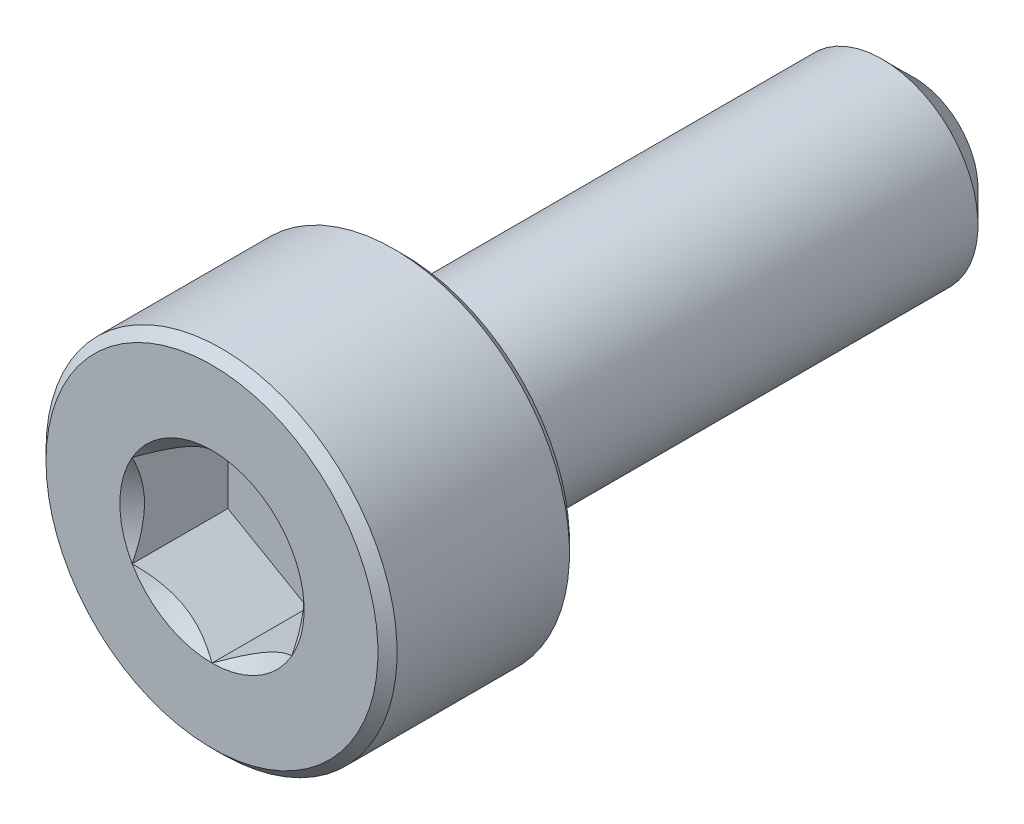
ISO-10303-21;
HEADER;
FILE_DESCRIPTION(('STEP AP214'),'2;1');
FILE_NAME('part.step','',(''),(''),'','','');
FILE_SCHEMA(('AUTOMOTIVE_DESIGN { 1 0 10303 214 1 1 1 1 }'));
ENDSEC;
DATA;
#1=APPLICATION_CONTEXT('core data for automotive mechanical design processes');
#2=APPLICATION_PROTOCOL_DEFINITION('international standard','automotive_design',2000,#1);
#3=PRODUCT_CONTEXT('',#1,'mechanical');
#4=PRODUCT('Part','Part','',(#3));
#5=PRODUCT_RELATED_PRODUCT_CATEGORY('part','',(#4));
#6=PRODUCT_DEFINITION_FORMATION('','',#4);
#7=PRODUCT_DEFINITION_CONTEXT('part definition',#1,'design');
#8=PRODUCT_DEFINITION('design','',#6,#7);
#9=PRODUCT_DEFINITION_SHAPE('','',#8);
#10=(LENGTH_UNIT() NAMED_UNIT(*) SI_UNIT(.MILLI.,.METRE.));
#11=(NAMED_UNIT(*) PLANE_ANGLE_UNIT() SI_UNIT($,.RADIAN.));
#12=(NAMED_UNIT(*) SI_UNIT($,.STERADIAN.) SOLID_ANGLE_UNIT());
#13=UNCERTAINTY_MEASURE_WITH_UNIT(LENGTH_MEASURE(1.E-05),#10,'distance_accuracy_value','');
#14=(GEOMETRIC_REPRESENTATION_CONTEXT(3) GLOBAL_UNCERTAINTY_ASSIGNED_CONTEXT((#13)) GLOBAL_UNIT_ASSIGNED_CONTEXT((#10,
#11,#12)) REPRESENTATION_CONTEXT('',''));
#15=CARTESIAN_POINT('',(0.,0.,0.));
#16=DIRECTION('',(0.,0.,1.));
#17=DIRECTION('',(1.,0.,0.));
#18=AXIS2_PLACEMENT_3D('',#15,#16,#17);
#19=CARTESIAN_POINT('',(0.,2.6,5.5));
#20=DIRECTION('',(0.,0.,1.));
#21=DIRECTION('',(1.,0.,0.));
#22=AXIS2_PLACEMENT_3D('',#19,#20,#21);
#23=PLANE('',#22);
#24=CARTESIAN_POINT('',(0.,0.,5.5));
#25=DIRECTION('',(0.,0.,1.));
#26=DIRECTION('',(1.,0.,0.));
#27=AXIS2_PLACEMENT_3D('',#24,#25,#26);
#28=CIRCLE('',#27,1.44337567297406);
#29=CARTESIAN_POINT('',(1.25,0.721687836487032,5.5));
#30=VERTEX_POINT('',#29);
#31=CARTESIAN_POINT('',(0.,1.44337567297406,5.5));
#32=VERTEX_POINT('',#31);
#33=EDGE_CURVE('E92',#30,#32,#28,.T.);
#34=ORIENTED_EDGE('',*,*,#33,.F.);
#35=CARTESIAN_POINT('',(1.25,-0.721687836487033,5.5));
#36=VERTEX_POINT('',#35);
#37=EDGE_CURVE('E52',#36,#30,#28,.T.);
#38=ORIENTED_EDGE('',*,*,#37,.F.);
#39=CARTESIAN_POINT('',(0.,-1.44337567297406,5.5));
#40=VERTEX_POINT('',#39);
#41=EDGE_CURVE('E278',#40,#36,#28,.T.);
#42=ORIENTED_EDGE('',*,*,#41,.F.);
#43=CARTESIAN_POINT('',(-1.25,-0.72168783648703,5.5));
#44=VERTEX_POINT('',#43);
#45=EDGE_CURVE('E59',#44,#40,#28,.T.);
#46=ORIENTED_EDGE('',*,*,#45,.F.);
#47=CARTESIAN_POINT('',(-1.25,0.721687836487034,5.5));
#48=VERTEX_POINT('',#47);
#49=EDGE_CURVE('E128',#48,#44,#28,.T.);
#50=ORIENTED_EDGE('',*,*,#49,.F.);
#51=EDGE_CURVE('E101',#32,#48,#28,.T.);
#52=ORIENTED_EDGE('',*,*,#51,.F.);
#53=EDGE_LOOP('',(#34,#38,#42,#46,#50,#52));
#54=FACE_BOUND('',#53,.T.);
#55=CARTESIAN_POINT('',(0.,0.,5.5));
#56=DIRECTION('',(0.,0.,-1.));
#57=DIRECTION('',(-1.,0.,0.));
#58=AXIS2_PLACEMENT_3D('',#55,#56,#57);
#59=CIRCLE('',#58,2.6);
#60=CARTESIAN_POINT('',(-2.6,0.,5.5));
#61=VERTEX_POINT('',#60);
#62=EDGE_CURVE('E46',#61,#61,#59,.T.);
#63=ORIENTED_EDGE('',*,*,#62,.F.);
#64=EDGE_LOOP('',(#63));
#65=FACE_BOUND('',#64,.T.);
#66=ADVANCED_FACE('F33',(#54,#65),#23,.T.);
#67=CARTESIAN_POINT('',(0.,0.,5.35));
#68=DIRECTION('',(0.,0.,-1.));
#69=DIRECTION('',(-1.,0.,0.));
#70=AXIS2_PLACEMENT_3D('',#67,#68,#69);
#71=CONICAL_SURFACE('',#70,2.75,0.785398163397443);
#72=ORIENTED_EDGE('',*,*,#62,.T.);
#73=EDGE_LOOP('',(#72));
#74=FACE_BOUND('',#73,.T.);
#75=CARTESIAN_POINT('',(0.,0.,5.35));
#76=DIRECTION('',(0.,0.,-1.));
#77=DIRECTION('',(-1.,0.,0.));
#78=AXIS2_PLACEMENT_3D('',#75,#76,#77);
#79=CIRCLE('',#78,2.75);
#80=CARTESIAN_POINT('',(-2.75,0.,5.35));
#81=VERTEX_POINT('',#80);
#82=EDGE_CURVE('E212',#81,#81,#79,.T.);
#83=ORIENTED_EDGE('',*,*,#82,.F.);
#84=EDGE_LOOP('',(#83));
#85=FACE_BOUND('',#84,.T.);
#86=ADVANCED_FACE('F217',(#74,#85),#71,.T.);
#87=CARTESIAN_POINT('',(0.,0.,-5.5));
#88=DIRECTION('',(0.,0.,-1.));
#89=DIRECTION('',(-1.,0.,0.));
#90=AXIS2_PLACEMENT_3D('',#87,#88,#89);
#91=CYLINDRICAL_SURFACE('',#90,2.75);
#92=ORIENTED_EDGE('',*,*,#82,.T.);
#93=EDGE_LOOP('',(#92));
#94=FACE_BOUND('',#93,.T.);
#95=CARTESIAN_POINT('',(0.,0.,2.65));
#96=DIRECTION('',(0.,0.,-1.));
#97=DIRECTION('',(-1.,0.,0.));
#98=AXIS2_PLACEMENT_3D('',#95,#96,#97);
#99=CIRCLE('',#98,2.75);
#100=CARTESIAN_POINT('',(-2.75,0.,2.65));
#101=VERTEX_POINT('',#100);
#102=EDGE_CURVE('E209',#101,#101,#99,.T.);
#103=ORIENTED_EDGE('',*,*,#102,.F.);
#104=EDGE_LOOP('',(#103));
#105=FACE_BOUND('',#104,.T.);
#106=ADVANCED_FACE('F223',(#94,#105),#91,.T.);
#107=CARTESIAN_POINT('',(0.,0.,2.5));
#108=DIRECTION('',(0.,0.,1.));
#109=DIRECTION('',(1.,0.,0.));
#110=AXIS2_PLACEMENT_3D('',#107,#108,#109);
#111=CONICAL_SURFACE('',#110,2.6,0.785398163397447);
#112=ORIENTED_EDGE('',*,*,#102,.T.);
#113=EDGE_LOOP('',(#112));
#114=FACE_BOUND('',#113,.T.);
#115=CARTESIAN_POINT('',(0.,0.,2.5));
#116=DIRECTION('',(0.,0.,-1.));
#117=DIRECTION('',(-1.,0.,0.));
#118=AXIS2_PLACEMENT_3D('',#115,#116,#117);
#119=CIRCLE('',#118,2.6);
#120=CARTESIAN_POINT('',(-2.6,0.,2.5));
#121=VERTEX_POINT('',#120);
#122=EDGE_CURVE('E206',#121,#121,#119,.T.);
#123=ORIENTED_EDGE('',*,*,#122,.F.);
#124=EDGE_LOOP('',(#123));
#125=FACE_BOUND('',#124,.T.);
#126=ADVANCED_FACE('F227',(#114,#125),#111,.T.);
#127=CARTESIAN_POINT('',(0.,2.6,2.5));
#128=DIRECTION('',(0.,0.,-1.));
#129=DIRECTION('',(-1.,0.,0.));
#130=AXIS2_PLACEMENT_3D('',#127,#128,#129);
#131=PLANE('',#130);
#132=ORIENTED_EDGE('',*,*,#122,.T.);
#133=EDGE_LOOP('',(#132));
#134=FACE_BOUND('',#133,.T.);
#135=CARTESIAN_POINT('',(0.,0.,2.5));
#136=DIRECTION('',(0.,0.,-1.));
#137=DIRECTION('',(-1.,0.,0.));
#138=AXIS2_PLACEMENT_3D('',#135,#136,#137);
#139=CIRCLE('',#138,1.5);
#140=CARTESIAN_POINT('',(-1.5,0.,2.5));
#141=VERTEX_POINT('',#140);
#142=EDGE_CURVE('E203',#141,#141,#139,.T.);
#143=ORIENTED_EDGE('',*,*,#142,.F.);
#144=EDGE_LOOP('',(#143));
#145=FACE_BOUND('',#144,.T.);
#146=ADVANCED_FACE('F233',(#134,#145),#131,.T.);
#147=CARTESIAN_POINT('',(0.,0.,-5.5));
#148=DIRECTION('',(0.,0.,-1.));
#149=DIRECTION('',(-1.,0.,0.));
#150=AXIS2_PLACEMENT_3D('',#147,#148,#149);
#151=CYLINDRICAL_SURFACE('',#150,1.5);
#152=ORIENTED_EDGE('',*,*,#142,.T.);
#153=EDGE_LOOP('',(#152));
#154=FACE_BOUND('',#153,.T.);
#155=CARTESIAN_POINT('',(0.,0.,-5.));
#156=DIRECTION('',(0.,0.,-1.));
#157=DIRECTION('',(-1.,0.,0.));
#158=AXIS2_PLACEMENT_3D('',#155,#156,#157);
#159=CIRCLE('',#158,1.5);
#160=CARTESIAN_POINT('',(-1.5,0.,-5.));
#161=VERTEX_POINT('',#160);
#162=EDGE_CURVE('E200',#161,#161,#159,.T.);
#163=ORIENTED_EDGE('',*,*,#162,.F.);
#164=EDGE_LOOP('',(#163));
#165=FACE_BOUND('',#164,.T.);
#166=ADVANCED_FACE('F237',(#154,#165),#151,.T.);
#167=CARTESIAN_POINT('',(0.,0.,-5.5));
#168=DIRECTION('',(0.,0.,1.));
#169=DIRECTION('',(1.,0.,0.));
#170=AXIS2_PLACEMENT_3D('',#167,#168,#169);
#171=CONICAL_SURFACE('',#170,1.,0.785398163397445);
#172=ORIENTED_EDGE('',*,*,#162,.T.);
#173=EDGE_LOOP('',(#172));
#174=FACE_BOUND('',#173,.T.);
#175=CARTESIAN_POINT('',(0.,0.,-5.5));
#176=DIRECTION('',(0.,0.,-1.));
#177=DIRECTION('',(-1.,0.,0.));
#178=AXIS2_PLACEMENT_3D('',#175,#176,#177);
#179=CIRCLE('',#178,1.);
#180=CARTESIAN_POINT('',(-1.,0.,-5.5));
#181=VERTEX_POINT('',#180);
#182=EDGE_CURVE('E188',#181,#181,#179,.T.);
#183=ORIENTED_EDGE('',*,*,#182,.F.);
#184=EDGE_LOOP('',(#183));
#185=FACE_BOUND('',#184,.T.);
#186=ADVANCED_FACE('F240',(#174,#185),#171,.T.);
#187=CARTESIAN_POINT('',(0.,1.,-5.5));
#188=DIRECTION('',(0.,0.,-1.));
#189=DIRECTION('',(-1.,0.,0.));
#190=AXIS2_PLACEMENT_3D('',#187,#188,#189);
#191=PLANE('',#190);
#192=ORIENTED_EDGE('',*,*,#182,.T.);
#193=EDGE_LOOP('',(#192));
#194=FACE_BOUND('',#193,.T.);
#195=ADVANCED_FACE('F161',(#194),#191,.T.);
#196=CARTESIAN_POINT('',(0.,0.,5.5));
#197=DIRECTION('',(0.,0.,1.));
#198=DIRECTION('',(1.,0.,0.));
#199=AXIS2_PLACEMENT_3D('',#196,#197,#198);
#200=CONICAL_SURFACE('',#199,1.44337567297406,0.78539816339745);
#201=ORIENTED_EDGE('',*,*,#51,.T.);
#202=CARTESIAN_POINT('',(0.000199999999999744,1.4434911430279,5.50011548390914));
#203=CARTESIAN_POINT('',(-0.0427751670715871,1.41867941875065,5.47532166805511));
#204=CARTESIAN_POINT('',(-0.0864690047459485,1.39345276980743,5.45198373441869));
#205=CARTESIAN_POINT('',(-0.175565930841942,1.34201263554194,5.40925200408454));
#206=CARTESIAN_POINT('',(-0.220977498357065,1.31579425481276,5.38988199236042));
#207=CARTESIAN_POINT('',(-0.31254782093526,1.26292610442246,5.35670048341348));
#208=CARTESIAN_POINT('',(-0.358683240175886,1.23628980770471,5.34280555905266));
#209=CARTESIAN_POINT('',(-0.451970080407593,1.18243062538508,5.32139728216064));
#210=CARTESIAN_POINT('',(-0.49911864913638,1.15520938653761,5.31386794156679));
#211=CARTESIAN_POINT('',(-0.580373556887253,1.10829684367467,5.3070744980507));
#212=CARTESIAN_POINT('',(-0.614374876627941,1.08866617256958,5.30606855910435));
#213=CARTESIAN_POINT('',(-0.682317764432478,1.04943932800611,5.30776141491132));
#214=CARTESIAN_POINT('',(-0.716259317655658,1.02984316311599,5.31046102721554));
#215=CARTESIAN_POINT('',(-0.7838148564575,0.990839954603499,5.31940893031638));
#216=CARTESIAN_POINT('',(-0.817428507286775,0.971433104248771,5.32566052589971));
#217=CARTESIAN_POINT('',(-0.884094638217814,0.932943395609905,5.34137568141391));
#218=CARTESIAN_POINT('',(-0.917146871030296,0.9138606800983,5.35084062008746));
#219=CARTESIAN_POINT('',(-1.00179969160026,0.864986351354568,5.37893139068759));
#220=CARTESIAN_POINT('',(-1.05286649242964,0.835502920149076,5.3996701574522));
#221=CARTESIAN_POINT('',(-1.15300085411326,0.777690319475909,5.44638713467148));
#222=CARTESIAN_POINT('',(-1.20207431157827,0.749357745598417,5.47234829594677));
#223=CARTESIAN_POINT('',(-1.2502,0.721572366433195,5.50011548390914));
#224=B_SPLINE_CURVE_WITH_KNOTS('',3,(#202,#203,#204,#205,#206,#207,#208,#209,#210,#211,#212,
#213,#214,#215,#216,#217,#218,#219,#220,#221,#222,#223),.UNSPECIFIED.,.F.,.F.,(4,2,2,2,2,2,2,2,
2,2,4),(0.,0.166533409618304,0.334037607289762,0.498880396489698,0.663307919240275,
0.780963963458827,0.898645970148453,1.01643764860773,1.1342799317155,1.32148652032141,
1.50809158792574),.UNSPECIFIED.);
#225=EDGE_CURVE('E11',#32,#48,#224,.T.);
#226=ORIENTED_EDGE('',*,*,#225,.F.);
#227=EDGE_LOOP('',(#201,#226));
#228=FACE_BOUND('',#227,.T.);
#229=ADVANCED_FACE('F105',(#228),#200,.F.);
#230=ORIENTED_EDGE('',*,*,#49,.T.);
#231=CARTESIAN_POINT('',(-1.25,-1.38510182026142,5.92237003651893));
#232=CARTESIAN_POINT('',(-1.25,-1.35111986791654,5.89714624624165));
#233=CARTESIAN_POINT('',(-1.25,-1.31694282798165,5.87218595709871));
#234=CARTESIAN_POINT('',(-1.25,-1.24812142703777,5.82289946459782));
#235=CARTESIAN_POINT('',(-1.25,-1.21347694519278,5.79857343015524));
#236=CARTESIAN_POINT('',(-1.25,-1.10822083307585,5.72636172374247));
#237=CARTESIAN_POINT('',(-1.25,-1.03680313809814,5.67963105654718));
#238=CARTESIAN_POINT('',(-1.25,-0.887382774503049,5.58837288422405));
#239=CARTESIAN_POINT('',(-1.25,-0.809230860354648,5.54408680062095));
#240=CARTESIAN_POINT('',(-1.25,-0.649095969627881,5.46341771993846));
#241=CARTESIAN_POINT('',(-1.25,-0.567127025778808,5.42700818374294));
#242=CARTESIAN_POINT('',(-1.25,-0.443557329507033,5.38248253765294));
#243=CARTESIAN_POINT('',(-1.25,-0.403672751512107,5.36961750891589));
#244=CARTESIAN_POINT('',(-1.25,-0.322988211982144,5.34709732599784));
#245=CARTESIAN_POINT('',(-1.25,-0.282188183066515,5.33744240892579));
#246=CARTESIAN_POINT('',(-1.25,-0.200572985420666,5.32199119638416));
#247=CARTESIAN_POINT('',(-1.25,-0.159769911896366,5.31613197737595));
#248=CARTESIAN_POINT('',(-1.25,-0.0777868304089239,5.30837795446847));
#249=CARTESIAN_POINT('',(-1.25,-0.0366068784025135,5.30648257133364));
#250=CARTESIAN_POINT('',(-1.25,0.0444682995491154,5.30677812945619));
#251=CARTESIAN_POINT('',(-1.25,0.0843640378229438,5.30884503442731));
#252=CARTESIAN_POINT('',(-1.25,0.163790547253528,5.31668957022574));
#253=CARTESIAN_POINT('',(-1.25,0.203321243504861,5.3224679461945));
#254=CARTESIAN_POINT('',(-1.25,0.282393986569086,5.33752741684666));
#255=CARTESIAN_POINT('',(-1.25,0.321924894821446,5.34686615693867));
#256=CARTESIAN_POINT('',(-1.25,0.400129025325507,5.36856655334425));
#257=CARTESIAN_POINT('',(-1.25,0.438802336675167,5.380927894012));
#258=CARTESIAN_POINT('',(-1.25,0.563172796674043,5.42526147457396));
#259=CARTESIAN_POINT('',(-1.25,0.647028633361639,5.46238856081833));
#260=CARTESIAN_POINT('',(-1.25,0.810774511829944,5.54485212067595));
#261=CARTESIAN_POINT('',(-1.25,0.890648632035888,5.59021863392705));
#262=CARTESIAN_POINT('',(-1.25,1.04325497137231,5.68372167893417));
#263=CARTESIAN_POINT('',(-1.25,1.11614441495489,5.73160472191527));
#264=CARTESIAN_POINT('',(-1.25,1.22353402780521,5.80558839420389));
#265=CARTESIAN_POINT('',(-1.25,1.25886567990417,5.83050307314204));
#266=CARTESIAN_POINT('',(-1.25,1.32904842299966,5.88098117650382));
#267=CARTESIAN_POINT('',(-1.25,1.36389964210964,5.90654442260414));
#268=CARTESIAN_POINT('',(-1.25,1.39855118205095,5.93237628525925));
#269=B_SPLINE_CURVE_WITH_KNOTS('',3,(#231,#232,#233,#234,#235,#236,#237,#238,#239,#240,#241,
#242,#243,#244,#245,#246,#247,#248,#249,#250,#251,#252,#253,#254,#255,#256,#257,#258,#259,#260,
#261,#262,#263,#264,#265,#266,#267,#268),.UNSPECIFIED.,.F.,.F.,(4,2,2,2,2,2,2,2,2,2,2,2,2,2,2,2,
2,2,4),(0.,0.126957685892467,0.253948844888988,0.50986920827304,0.779115443569667,
1.04743984536898,1.17305649245659,1.29868241592515,1.42216852630225,1.5456365903859,
1.6653025991614,1.78499264045314,1.90670905612004,2.02841276654157,2.30272027119573,
2.57804870101488,2.83955156876987,2.96924486861395,3.09890288771825),.UNSPECIFIED.);
#270=EDGE_CURVE('E100',#48,#44,#269,.F.);
#271=ORIENTED_EDGE('',*,*,#270,.F.);
#272=EDGE_LOOP('',(#230,#271));
#273=FACE_BOUND('',#272,.T.);
#274=ADVANCED_FACE('F255',(#273),#200,.F.);
#275=ORIENTED_EDGE('',*,*,#45,.T.);
#276=CARTESIAN_POINT('',(-1.2502,-0.721572366433195,5.50011548390914));
#277=CARTESIAN_POINT('',(-1.20722483292841,-0.746384090710444,5.47532166805511));
#278=CARTESIAN_POINT('',(-1.16353099525405,-0.771610739653665,5.45198373441869));
#279=CARTESIAN_POINT('',(-1.07443406915806,-0.823050873919155,5.40925200408454));
#280=CARTESIAN_POINT('',(-1.02902250164294,-0.849269254648334,5.38988199236042));
#281=CARTESIAN_POINT('',(-0.93745217906474,-0.902137405038636,5.35670048341348));
#282=CARTESIAN_POINT('',(-0.891316759824114,-0.928773701756388,5.34280555905266));
#283=CARTESIAN_POINT('',(-0.798029919592407,-0.982632884076013,5.32139728216064));
#284=CARTESIAN_POINT('',(-0.75088135086362,-1.00985412292348,5.31386794156679));
#285=CARTESIAN_POINT('',(-0.669626443112747,-1.05676666578643,5.3070744980507));
#286=CARTESIAN_POINT('',(-0.635625123372059,-1.07639733689152,5.30606855910435));
#287=CARTESIAN_POINT('',(-0.567682235567522,-1.11562418145499,5.30776141491132));
#288=CARTESIAN_POINT('',(-0.533740682344342,-1.1352203463451,5.31046102721554));
#289=CARTESIAN_POINT('',(-0.4661851435425,-1.1742235548576,5.31940893031638));
#290=CARTESIAN_POINT('',(-0.432571492713225,-1.19363040521233,5.32566052589971));
#291=CARTESIAN_POINT('',(-0.365905361782187,-1.23212011385119,5.34137568141391));
#292=CARTESIAN_POINT('',(-0.332853128969704,-1.2512028293628,5.35084062008746));
#293=CARTESIAN_POINT('',(-0.248200308399735,-1.30007715810653,5.37893139068759));
#294=CARTESIAN_POINT('',(-0.197133507570362,-1.32956058931202,5.3996701574522));
#295=CARTESIAN_POINT('',(-0.0969991458867452,-1.38737318998519,5.44638713467148));
#296=CARTESIAN_POINT('',(-0.0479256884217307,-1.41570576386268,5.47234829594677));
#297=CARTESIAN_POINT('',(0.000199999999999764,-1.4434911430279,5.50011548390914));
#298=B_SPLINE_CURVE_WITH_KNOTS('',3,(#276,#277,#278,#279,#280,#281,#282,#283,#284,#285,#286,
#287,#288,#289,#290,#291,#292,#293,#294,#295,#296,#297),.UNSPECIFIED.,.F.,.F.,(4,2,2,2,2,2,2,2,
2,2,4),(0.,0.166533409618304,0.334037607289762,0.498880396489699,0.663307919240275,
0.780963963458827,0.898645970148454,1.01643764860773,1.1342799317155,1.32148652032141,
1.50809158792574),.UNSPECIFIED.);
#299=EDGE_CURVE('E137',#44,#40,#298,.T.);
#300=ORIENTED_EDGE('',*,*,#299,.F.);
#301=EDGE_LOOP('',(#275,#300));
#302=FACE_BOUND('',#301,.T.);
#303=ADVANCED_FACE('F259',(#302),#200,.F.);
#304=ORIENTED_EDGE('',*,*,#41,.T.);
#305=CARTESIAN_POINT('',(-0.000200000000000316,-1.4434911430279,5.50011548390914));
#306=CARTESIAN_POINT('',(0.0427751670715864,-1.41867941875065,5.47532166805511));
#307=CARTESIAN_POINT('',(0.0864690047459477,-1.39345276980743,5.45198373441869));
#308=CARTESIAN_POINT('',(0.175565930841942,-1.34201263554194,5.40925200408454));
#309=CARTESIAN_POINT('',(0.220977498357064,-1.31579425481276,5.38988199236042));
#310=CARTESIAN_POINT('',(0.31254782093526,-1.26292610442246,5.35670048341348));
#311=CARTESIAN_POINT('',(0.358683240175886,-1.23628980770471,5.34280555905266));
#312=CARTESIAN_POINT('',(0.451970080407592,-1.18243062538508,5.32139728216064));
#313=CARTESIAN_POINT('',(0.49911864913638,-1.15520938653761,5.31386794156679));
#314=CARTESIAN_POINT('',(0.580373556887252,-1.10829684367467,5.3070744980507));
#315=CARTESIAN_POINT('',(0.614374876627941,-1.08866617256958,5.30606855910435));
#316=CARTESIAN_POINT('',(0.682317764432477,-1.04943932800611,5.30776141491132));
#317=CARTESIAN_POINT('',(0.716259317655657,-1.02984316311599,5.31046102721554));
#318=CARTESIAN_POINT('',(0.783814856457499,-0.9908399546035,5.31940893031638));
#319=CARTESIAN_POINT('',(0.817428507286775,-0.971433104248771,5.32566052589971));
#320=CARTESIAN_POINT('',(0.884094638217813,-0.932943395609906,5.34137568141391));
#321=CARTESIAN_POINT('',(0.917146871030295,-0.913860680098301,5.35084062008746));
#322=CARTESIAN_POINT('',(1.00179969160026,-0.864986351354568,5.37893139068759));
#323=CARTESIAN_POINT('',(1.05286649242964,-0.835502920149076,5.3996701574522));
#324=CARTESIAN_POINT('',(1.15300085411325,-0.777690319475909,5.44638713467148));
#325=CARTESIAN_POINT('',(1.20207431157827,-0.749357745598418,5.47234829594677));
#326=CARTESIAN_POINT('',(1.2502,-0.721572366433196,5.50011548390914));
#327=B_SPLINE_CURVE_WITH_KNOTS('',3,(#305,#306,#307,#308,#309,#310,#311,#312,#313,#314,#315,
#316,#317,#318,#319,#320,#321,#322,#323,#324,#325,#326),.UNSPECIFIED.,.F.,.F.,(4,2,2,2,2,2,2,2,
2,2,4),(0.,0.166533409618304,0.334037607289762,0.498880396489698,0.663307919240274,
0.780963963458827,0.898645970148453,1.01643764860773,1.1342799317155,1.32148652032141,
1.50809158792573),.UNSPECIFIED.);
#328=EDGE_CURVE('E280',#40,#36,#327,.T.);
#329=ORIENTED_EDGE('',*,*,#328,.F.);
#330=EDGE_LOOP('',(#304,#329));
#331=FACE_BOUND('',#330,.T.);
#332=ADVANCED_FACE('F268',(#331),#200,.F.);
#333=ORIENTED_EDGE('',*,*,#37,.T.);
#334=CARTESIAN_POINT('',(1.25,-1.38510181874983,5.92237003539674));
#335=CARTESIAN_POINT('',(1.25,-1.3511198664462,5.89714624516244));
#336=CARTESIAN_POINT('',(1.25,-1.31694282655271,5.87218595606241));
#337=CARTESIAN_POINT('',(1.25,-1.24812142569208,5.82289946364711));
#338=CARTESIAN_POINT('',(1.25,-1.21347694388892,5.7985734292472));
#339=CARTESIAN_POINT('',(1.25,-1.10822083190007,5.72636172296323));
#340=CARTESIAN_POINT('',(1.25,-1.0368031370095,5.67963105585343));
#341=CARTESIAN_POINT('',(1.25,-0.887382773604424,5.58837288370571));
#342=CARTESIAN_POINT('',(1.25,-0.809230859559389,5.54408680019188));
#343=CARTESIAN_POINT('',(1.25,-0.649095969048194,5.46341771967474));
#344=CARTESIAN_POINT('',(1.25,-0.567127025311258,5.42700818355541));
#345=CARTESIAN_POINT('',(1.25,-0.443557329124526,5.38248253752399));
#346=CARTESIAN_POINT('',(1.25,-0.403672751095206,5.36961750878661));
#347=CARTESIAN_POINT('',(1.25,-0.322988211495524,5.34709732587494));
#348=CARTESIAN_POINT('',(1.25,-0.28218818254457,5.3374424088096));
#349=CARTESIAN_POINT('',(1.25,-0.200572984829335,5.32199119628927));
#350=CARTESIAN_POINT('',(1.25,-0.159769911270982,5.31613197729548));
#351=CARTESIAN_POINT('',(1.25,-0.0777868297167932,5.30837795442431));
#352=CARTESIAN_POINT('',(1.25,-0.0366068776776873,5.30648257131138));
#353=CARTESIAN_POINT('',(1.25,0.0444683003388063,5.30677812948321));
#354=CARTESIAN_POINT('',(1.25,0.0843640386448799,5.3088450344818));
#355=CARTESIAN_POINT('',(1.25,0.16379054813703,5.3166895703397));
#356=CARTESIAN_POINT('',(1.25,0.203321244417682,5.32246794634046));
#357=CARTESIAN_POINT('',(1.25,0.282393987539771,5.33752741705993));
#358=CARTESIAN_POINT('',(1.25,0.321924895820597,5.34686615718743));
#359=CARTESIAN_POINT('',(1.25,0.400129026379048,5.36856655366507));
#360=CARTESIAN_POINT('',(1.25,0.438802337754633,5.38092789436938));
#361=CARTESIAN_POINT('',(1.25,0.563172797994066,5.42526147510656));
#362=CARTESIAN_POINT('',(1.25,0.647028634884195,5.46238856151275));
#363=CARTESIAN_POINT('',(1.25,0.810774513742062,5.54485212171168));
#364=CARTESIAN_POINT('',(1.25,0.890648634134939,5.59021863514241));
#365=CARTESIAN_POINT('',(1.25,1.04325497380785,5.68372168049333));
#366=CARTESIAN_POINT('',(1.25,1.11614441754118,5.73160472363706));
#367=CARTESIAN_POINT('',(1.25,1.22353403061444,5.8055883961688));
#368=CARTESIAN_POINT('',(1.25,1.25886568278664,5.83050307518733));
#369=CARTESIAN_POINT('',(1.25,1.32904842602817,5.8809811787098));
#370=CARTESIAN_POINT('',(1.25,1.36389964521094,5.90654442489043));
#371=CARTESIAN_POINT('',(1.25,1.3985511852249,5.93237628762573));
#372=B_SPLINE_CURVE_WITH_KNOTS('',3,(#334,#335,#336,#337,#338,#339,#340,#341,#342,#343,#344,
#345,#346,#347,#348,#349,#350,#351,#352,#353,#354,#355,#356,#357,#358,#359,#360,#361,#362,#363,
#364,#365,#366,#367,#368,#369,#370,#371),.UNSPECIFIED.,.F.,.F.,(4,2,2,2,2,2,2,2,2,2,2,2,2,2,2,2,
2,2,4),(0.,0.126957685716233,0.253948844536467,0.509869207561397,0.779115442456379,
1.04743984385779,1.17305649104353,1.29868241461005,1.42216852508156,1.54563658925964,
1.66530259813563,1.78499263952808,1.9067090553025,2.02841276583151,2.30272027123448,
2.57804870180744,2.83955157020837,2.96924487037104,3.0989028897939),.UNSPECIFIED.);
#373=EDGE_CURVE('E117',#36,#30,#372,.T.);
#374=ORIENTED_EDGE('',*,*,#373,.F.);
#375=EDGE_LOOP('',(#333,#374));
#376=FACE_BOUND('',#375,.T.);
#377=ADVANCED_FACE('F262',(#376),#200,.F.);
#378=ORIENTED_EDGE('',*,*,#33,.T.);
#379=CARTESIAN_POINT('',(1.2502,0.721572366433195,5.50011548390914));
#380=CARTESIAN_POINT('',(1.20722483292841,0.746384090710444,5.47532166805511));
#381=CARTESIAN_POINT('',(1.16353099525405,0.771610739653664,5.45198373441868));
#382=CARTESIAN_POINT('',(1.07443406915806,0.823050873919155,5.40925200408454));
#383=CARTESIAN_POINT('',(1.02902250164294,0.849269254648333,5.38988199236042));
#384=CARTESIAN_POINT('',(0.93745217906474,0.902137405038636,5.35670048341348));
#385=CARTESIAN_POINT('',(0.891316759824114,0.928773701756387,5.34280555905266));
#386=CARTESIAN_POINT('',(0.798029919592407,0.982632884076013,5.32139728216064));
#387=CARTESIAN_POINT('',(0.75088135086362,1.00985412292348,5.31386794156679));
#388=CARTESIAN_POINT('',(0.669626443112747,1.05676666578643,5.3070744980507));
#389=CARTESIAN_POINT('',(0.635625123372059,1.07639733689152,5.30606855910435));
#390=CARTESIAN_POINT('',(0.567682235567522,1.11562418145499,5.30776141491132));
#391=CARTESIAN_POINT('',(0.533740682344342,1.1352203463451,5.31046102721554));
#392=CARTESIAN_POINT('',(0.4661851435425,1.1742235548576,5.31940893031638));
#393=CARTESIAN_POINT('',(0.432571492713225,1.19363040521233,5.32566052589971));
#394=CARTESIAN_POINT('',(0.365905361782187,1.23212011385119,5.34137568141391));
#395=CARTESIAN_POINT('',(0.332853128969704,1.2512028293628,5.35084062008746));
#396=CARTESIAN_POINT('',(0.248200308399736,1.30007715810653,5.37893139068759));
#397=CARTESIAN_POINT('',(0.197133507570362,1.32956058931202,5.3996701574522));
#398=CARTESIAN_POINT('',(0.0969991458867451,1.38737318998519,5.44638713467148));
#399=CARTESIAN_POINT('',(0.0479256884217304,1.41570576386268,5.47234829594677));
#400=CARTESIAN_POINT('',(-0.000200000000000211,1.4434911430279,5.50011548390914));
#401=B_SPLINE_CURVE_WITH_KNOTS('',3,(#379,#380,#381,#382,#383,#384,#385,#386,#387,#388,#389,
#390,#391,#392,#393,#394,#395,#396,#397,#398,#399,#400),.UNSPECIFIED.,.F.,.F.,(4,2,2,2,2,2,2,2,
2,2,4),(0.,0.166533409618303,0.334037607289761,0.498880396489698,0.663307919240274,
0.780963963458826,0.898645970148452,1.01643764860773,1.13427993171549,1.32148652032141,
1.50809158792573),.UNSPECIFIED.);
#402=EDGE_CURVE('E96',#30,#32,#401,.T.);
#403=ORIENTED_EDGE('',*,*,#402,.F.);
#404=EDGE_LOOP('',(#378,#403));
#405=FACE_BOUND('',#404,.T.);
#406=ADVANCED_FACE('F94',(#405),#200,.F.);
#407=CARTESIAN_POINT('',(0.,0.,4.));
#408=DIRECTION('',(0.,0.,1.));
#409=DIRECTION('',(1.,0.,0.));
#410=AXIS2_PLACEMENT_3D('',#407,#408,#409);
#411=PLANE('',#410);
#412=DIRECTION('',(-0.866025403784439,0.5,0.));
#413=VECTOR('',#412,1.);
#414=CARTESIAN_POINT('',(1.25,0.721687836487033,4.));
#415=LINE('',#414,#413);
#416=CARTESIAN_POINT('',(1.25,0.721687836487033,4.));
#417=VERTEX_POINT('',#416);
#418=CARTESIAN_POINT('',(0.,1.44337567297406,4.));
#419=VERTEX_POINT('',#418);
#420=EDGE_CURVE('E116',#417,#419,#415,.T.);
#421=ORIENTED_EDGE('',*,*,#420,.T.);
#422=DIRECTION('',(-0.866025403784439,-0.5,0.));
#423=VECTOR('',#422,1.);
#424=CARTESIAN_POINT('',(0.,1.44337567297406,4.));
#425=LINE('',#424,#423);
#426=CARTESIAN_POINT('',(-1.25,0.721687836487033,4.));
#427=VERTEX_POINT('',#426);
#428=EDGE_CURVE('E121',#419,#427,#425,.T.);
#429=ORIENTED_EDGE('',*,*,#428,.T.);
#430=DIRECTION('',(0.,-1.,0.));
#431=VECTOR('',#430,1.);
#432=CARTESIAN_POINT('',(-1.25,0.721687836487033,4.));
#433=LINE('',#432,#431);
#434=CARTESIAN_POINT('',(-1.25,-0.721687836487032,4.));
#435=VERTEX_POINT('',#434);
#436=EDGE_CURVE('E176',#427,#435,#433,.T.);
#437=ORIENTED_EDGE('',*,*,#436,.T.);
#438=DIRECTION('',(0.866025403784439,-0.5,0.));
#439=VECTOR('',#438,1.);
#440=CARTESIAN_POINT('',(-1.25,-0.721687836487032,4.));
#441=LINE('',#440,#439);
#442=CARTESIAN_POINT('',(0.,-1.44337567297406,4.));
#443=VERTEX_POINT('',#442);
#444=EDGE_CURVE('E179',#435,#443,#441,.T.);
#445=ORIENTED_EDGE('',*,*,#444,.T.);
#446=DIRECTION('',(0.866025403784439,0.5,0.));
#447=VECTOR('',#446,1.);
#448=CARTESIAN_POINT('',(0.,-1.44337567297406,4.));
#449=LINE('',#448,#447);
#450=CARTESIAN_POINT('',(1.25,-0.721687836487033,4.));
#451=VERTEX_POINT('',#450);
#452=EDGE_CURVE('E182',#443,#451,#449,.T.);
#453=ORIENTED_EDGE('',*,*,#452,.T.);
#454=DIRECTION('',(0.,1.,0.));
#455=VECTOR('',#454,1.);
#456=CARTESIAN_POINT('',(1.25,-0.721687836487033,4.));
#457=LINE('',#456,#455);
#458=EDGE_CURVE('E124',#451,#417,#457,.T.);
#459=ORIENTED_EDGE('',*,*,#458,.T.);
#460=EDGE_LOOP('',(#421,#429,#437,#445,#453,#459));
#461=FACE_BOUND('',#460,.T.);
#462=ADVANCED_FACE('F156',(#461),#411,.T.);
#463=CARTESIAN_POINT('',(0.,1.44337567297406,4.));
#464=DIRECTION('',(-0.5,0.866025403784439,0.));
#465=DIRECTION('',(-0.866025403784439,-0.5,0.));
#466=AXIS2_PLACEMENT_3D('',#463,#464,#465);
#467=PLANE('',#466);
#468=DIRECTION('',(0.,0.,1.));
#469=VECTOR('',#468,1.);
#470=CARTESIAN_POINT('',(0.,1.44337567297406,4.));
#471=LINE('',#470,#469);
#472=EDGE_CURVE('E113',#419,#32,#471,.T.);
#473=ORIENTED_EDGE('',*,*,#472,.T.);
#474=ORIENTED_EDGE('',*,*,#225,.T.);
#475=DIRECTION('',(0.,0.,1.));
#476=VECTOR('',#475,1.);
#477=CARTESIAN_POINT('',(-1.25,0.721687836487033,4.));
#478=LINE('',#477,#476);
#479=EDGE_CURVE('E123',#427,#48,#478,.T.);
#480=ORIENTED_EDGE('',*,*,#479,.F.);
#481=ORIENTED_EDGE('',*,*,#428,.F.);
#482=EDGE_LOOP('',(#473,#474,#480,#481));
#483=FACE_BOUND('',#482,.T.);
#484=ADVANCED_FACE('F119',(#483),#467,.F.);
#485=CARTESIAN_POINT('',(-1.25,0.721687836487033,4.));
#486=DIRECTION('',(-1.,0.,0.));
#487=DIRECTION('',(0.,-1.,0.));
#488=AXIS2_PLACEMENT_3D('',#485,#486,#487);
#489=PLANE('',#488);
#490=ORIENTED_EDGE('',*,*,#479,.T.);
#491=ORIENTED_EDGE('',*,*,#270,.T.);
#492=DIRECTION('',(0.,0.,1.));
#493=VECTOR('',#492,1.);
#494=CARTESIAN_POINT('',(-1.25,-0.721687836487032,4.));
#495=LINE('',#494,#493);
#496=EDGE_CURVE('E194',#435,#44,#495,.T.);
#497=ORIENTED_EDGE('',*,*,#496,.F.);
#498=ORIENTED_EDGE('',*,*,#436,.F.);
#499=EDGE_LOOP('',(#490,#491,#497,#498));
#500=FACE_BOUND('',#499,.T.);
#501=ADVANCED_FACE('F146',(#500),#489,.F.);
#502=CARTESIAN_POINT('',(-1.25,-0.721687836487032,4.));
#503=DIRECTION('',(-0.5,-0.866025403784439,0.));
#504=DIRECTION('',(0.866025403784439,-0.5,0.));
#505=AXIS2_PLACEMENT_3D('',#502,#503,#504);
#506=PLANE('',#505);
#507=ORIENTED_EDGE('',*,*,#496,.T.);
#508=ORIENTED_EDGE('',*,*,#299,.T.);
#509=DIRECTION('',(0.,0.,1.));
#510=VECTOR('',#509,1.);
#511=CARTESIAN_POINT('',(0.,-1.44337567297406,4.));
#512=LINE('',#511,#510);
#513=EDGE_CURVE('E191',#443,#40,#512,.T.);
#514=ORIENTED_EDGE('',*,*,#513,.F.);
#515=ORIENTED_EDGE('',*,*,#444,.F.);
#516=EDGE_LOOP('',(#507,#508,#514,#515));
#517=FACE_BOUND('',#516,.T.);
#518=ADVANCED_FACE('F149',(#517),#506,.F.);
#519=CARTESIAN_POINT('',(0.,-1.44337567297406,4.));
#520=DIRECTION('',(0.5,-0.866025403784439,0.));
#521=DIRECTION('',(0.866025403784439,0.5,0.));
#522=AXIS2_PLACEMENT_3D('',#519,#520,#521);
#523=PLANE('',#522);
#524=ORIENTED_EDGE('',*,*,#513,.T.);
#525=ORIENTED_EDGE('',*,*,#328,.T.);
#526=DIRECTION('',(0.,0.,1.));
#527=VECTOR('',#526,1.);
#528=CARTESIAN_POINT('',(1.25,-0.721687836487033,4.));
#529=LINE('',#528,#527);
#530=EDGE_CURVE('E189',#451,#36,#529,.T.);
#531=ORIENTED_EDGE('',*,*,#530,.F.);
#532=ORIENTED_EDGE('',*,*,#452,.F.);
#533=EDGE_LOOP('',(#524,#525,#531,#532));
#534=FACE_BOUND('',#533,.T.);
#535=ADVANCED_FACE('F286',(#534),#523,.F.);
#536=CARTESIAN_POINT('',(1.25,-0.721687836487033,4.));
#537=DIRECTION('',(1.,0.,0.));
#538=DIRECTION('',(0.,1.,0.));
#539=AXIS2_PLACEMENT_3D('',#536,#537,#538);
#540=PLANE('',#539);
#541=ORIENTED_EDGE('',*,*,#530,.T.);
#542=ORIENTED_EDGE('',*,*,#373,.T.);
#543=DIRECTION('',(0.,0.,1.));
#544=VECTOR('',#543,1.);
#545=CARTESIAN_POINT('',(1.25,0.721687836487033,4.));
#546=LINE('',#545,#544);
#547=EDGE_CURVE('E115',#417,#30,#546,.T.);
#548=ORIENTED_EDGE('',*,*,#547,.F.);
#549=ORIENTED_EDGE('',*,*,#458,.F.);
#550=EDGE_LOOP('',(#541,#542,#548,#549));
#551=FACE_BOUND('',#550,.T.);
#552=ADVANCED_FACE('F160',(#551),#540,.F.);
#553=CARTESIAN_POINT('',(1.25,0.721687836487033,4.));
#554=DIRECTION('',(0.5,0.866025403784439,0.));
#555=DIRECTION('',(-0.866025403784439,0.5,0.));
#556=AXIS2_PLACEMENT_3D('',#553,#554,#555);
#557=PLANE('',#556);
#558=ORIENTED_EDGE('',*,*,#547,.T.);
#559=ORIENTED_EDGE('',*,*,#402,.T.);
#560=ORIENTED_EDGE('',*,*,#472,.F.);
#561=ORIENTED_EDGE('',*,*,#420,.F.);
#562=EDGE_LOOP('',(#558,#559,#560,#561));
#563=FACE_BOUND('',#562,.T.);
#564=ADVANCED_FACE('F111',(#563),#557,.F.);
#565=CLOSED_SHELL('',(#66,#86,#106,#126,#146,#166,#186,#195,#229,#274,#303,#332,#377,#406,#462,
#484,#501,#518,#535,#552,#564));
#566=MANIFOLD_SOLID_BREP('B2',#565);
#567=ADVANCED_BREP_SHAPE_REPRESENTATION('',(#18,#566),#14);
#568=SHAPE_DEFINITION_REPRESENTATION(#9,#567);
ENDSEC;
END-ISO-10303-21;
